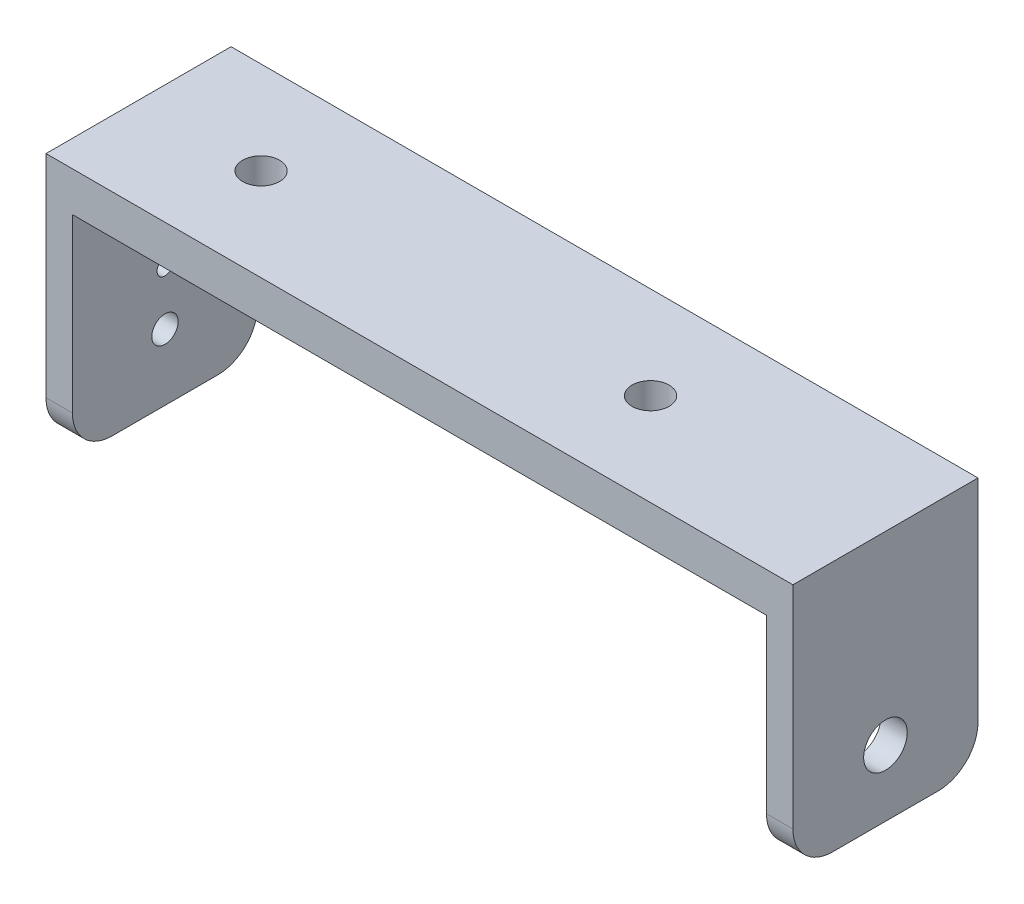
ISO-10303-21;
HEADER;
FILE_DESCRIPTION(('STEP AP214'),'2;1');
FILE_NAME('part.step','',(''),(''),'','','');
FILE_SCHEMA(('AUTOMOTIVE_DESIGN { 1 0 10303 214 1 1 1 1 }'));
ENDSEC;
DATA;
#1=APPLICATION_CONTEXT('core data for automotive mechanical design processes');
#2=APPLICATION_PROTOCOL_DEFINITION('international standard','automotive_design',2000,#1);
#3=PRODUCT_CONTEXT('',#1,'mechanical');
#4=PRODUCT('Part','Part','',(#3));
#5=PRODUCT_RELATED_PRODUCT_CATEGORY('part','',(#4));
#6=PRODUCT_DEFINITION_FORMATION('','',#4);
#7=PRODUCT_DEFINITION_CONTEXT('part definition',#1,'design');
#8=PRODUCT_DEFINITION('design','',#6,#7);
#9=PRODUCT_DEFINITION_SHAPE('','',#8);
#10=(LENGTH_UNIT() NAMED_UNIT(*) SI_UNIT(.MILLI.,.METRE.));
#11=(NAMED_UNIT(*) PLANE_ANGLE_UNIT() SI_UNIT($,.RADIAN.));
#12=(NAMED_UNIT(*) SI_UNIT($,.STERADIAN.) SOLID_ANGLE_UNIT());
#13=UNCERTAINTY_MEASURE_WITH_UNIT(LENGTH_MEASURE(1.E-05),#10,'distance_accuracy_value','');
#14=(GEOMETRIC_REPRESENTATION_CONTEXT(3) GLOBAL_UNCERTAINTY_ASSIGNED_CONTEXT((#13)) GLOBAL_UNIT_ASSIGNED_CONTEXT((#10,
#11,#12)) REPRESENTATION_CONTEXT('',''));
#15=CARTESIAN_POINT('',(0.,0.,0.));
#16=DIRECTION('',(0.,0.,1.));
#17=DIRECTION('',(1.,0.,0.));
#18=AXIS2_PLACEMENT_3D('',#15,#16,#17);
#19=CARTESIAN_POINT('',(0.,16.,14.));
#20=DIRECTION('',(0.,-1.,0.));
#21=DIRECTION('',(1.,0.,0.));
#22=AXIS2_PLACEMENT_3D('',#19,#20,#21);
#23=PLANE('',#22);
#24=CARTESIAN_POINT('',(-18.98,16.,7.));
#25=DIRECTION('',(0.,-1.,0.));
#26=DIRECTION('',(1.,0.,0.));
#27=AXIS2_PLACEMENT_3D('',#24,#25,#26);
#28=CIRCLE('',#27,1.4);
#29=CARTESIAN_POINT('',(-17.58,16.,7.));
#30=VERTEX_POINT('',#29);
#31=EDGE_CURVE('E253',#30,#30,#28,.T.);
#32=ORIENTED_EDGE('',*,*,#31,.F.);
#33=EDGE_LOOP('',(#32));
#34=FACE_BOUND('',#33,.T.);
#35=CARTESIAN_POINT('',(10.48,16.,7.));
#36=DIRECTION('',(0.,-1.,0.));
#37=DIRECTION('',(1.,0.,0.));
#38=AXIS2_PLACEMENT_3D('',#35,#36,#37);
#39=CIRCLE('',#38,1.4);
#40=CARTESIAN_POINT('',(11.88,16.,7.));
#41=VERTEX_POINT('',#40);
#42=EDGE_CURVE('E247',#41,#41,#39,.T.);
#43=ORIENTED_EDGE('',*,*,#42,.F.);
#44=EDGE_LOOP('',(#43));
#45=FACE_BOUND('',#44,.T.);
#46=DIRECTION('',(-1.,0.,0.));
#47=VECTOR('',#46,1.);
#48=CARTESIAN_POINT('',(0.,16.,0.));
#49=LINE('',#48,#47);
#50=CARTESIAN_POINT('',(26.25,16.,0.));
#51=VERTEX_POINT('',#50);
#52=CARTESIAN_POINT('',(-26.25,16.,0.));
#53=VERTEX_POINT('',#52);
#54=EDGE_CURVE('E152',#51,#53,#49,.T.);
#55=ORIENTED_EDGE('',*,*,#54,.F.);
#56=DIRECTION('',(0.,0.,-1.));
#57=VECTOR('',#56,1.);
#58=CARTESIAN_POINT('',(26.25,16.,14.));
#59=LINE('',#58,#57);
#60=CARTESIAN_POINT('',(26.25,16.,14.));
#61=VERTEX_POINT('',#60);
#62=EDGE_CURVE('E139',#61,#51,#59,.T.);
#63=ORIENTED_EDGE('',*,*,#62,.F.);
#64=DIRECTION('',(-1.,0.,0.));
#65=VECTOR('',#64,1.);
#66=CARTESIAN_POINT('',(0.,16.,14.));
#67=LINE('',#66,#65);
#68=CARTESIAN_POINT('',(-26.25,16.,14.));
#69=VERTEX_POINT('',#68);
#70=EDGE_CURVE('E146',#61,#69,#67,.T.);
#71=ORIENTED_EDGE('',*,*,#70,.T.);
#72=DIRECTION('',(0.,0.,-1.));
#73=VECTOR('',#72,1.);
#74=CARTESIAN_POINT('',(-26.25,16.,14.));
#75=LINE('',#74,#73);
#76=EDGE_CURVE('E175',#69,#53,#75,.T.);
#77=ORIENTED_EDGE('',*,*,#76,.T.);
#78=EDGE_LOOP('',(#55,#63,#71,#77));
#79=FACE_BOUND('',#78,.T.);
#80=ADVANCED_FACE('F41',(#34,#45,#79),#23,.T.);
#81=CARTESIAN_POINT('',(26.25,0.,14.));
#82=DIRECTION('',(-1.,0.,0.));
#83=DIRECTION('',(0.,0.,1.));
#84=AXIS2_PLACEMENT_3D('',#81,#82,#83);
#85=PLANE('',#84);
#86=CARTESIAN_POINT('',(26.25,5.00000000000001,7.));
#87=DIRECTION('',(-1.,0.,0.));
#88=DIRECTION('',(0.,0.,1.));
#89=AXIS2_PLACEMENT_3D('',#86,#87,#88);
#90=CIRCLE('',#89,1.65);
#91=CARTESIAN_POINT('',(26.25,5.00000000000001,8.65));
#92=VERTEX_POINT('',#91);
#93=EDGE_CURVE('E164',#92,#92,#90,.F.);
#94=ORIENTED_EDGE('',*,*,#93,.T.);
#95=EDGE_LOOP('',(#94));
#96=FACE_BOUND('',#95,.T.);
#97=DIRECTION('',(0.,0.,-1.));
#98=VECTOR('',#97,1.);
#99=CARTESIAN_POINT('',(26.25,0.,14.));
#100=LINE('',#99,#98);
#101=CARTESIAN_POINT('',(26.25,0.,11.));
#102=VERTEX_POINT('',#101);
#103=CARTESIAN_POINT('',(26.25,0.,3.));
#104=VERTEX_POINT('',#103);
#105=EDGE_CURVE('E154',#102,#104,#100,.T.);
#106=ORIENTED_EDGE('',*,*,#105,.F.);
#107=CARTESIAN_POINT('',(26.25,3.,11.));
#108=DIRECTION('',(-1.,0.,0.));
#109=DIRECTION('',(0.,0.,1.));
#110=AXIS2_PLACEMENT_3D('',#107,#108,#109);
#111=CIRCLE('',#110,3.);
#112=CARTESIAN_POINT('',(26.25,3.,14.));
#113=VERTEX_POINT('',#112);
#114=EDGE_CURVE('E141',#102,#113,#111,.T.);
#115=ORIENTED_EDGE('',*,*,#114,.T.);
#116=DIRECTION('',(0.,1.,0.));
#117=VECTOR('',#116,1.);
#118=CARTESIAN_POINT('',(26.25,0.,14.));
#119=LINE('',#118,#117);
#120=EDGE_CURVE('E134',#113,#61,#119,.T.);
#121=ORIENTED_EDGE('',*,*,#120,.T.);
#122=ORIENTED_EDGE('',*,*,#62,.T.);
#123=DIRECTION('',(0.,1.,0.));
#124=VECTOR('',#123,1.);
#125=CARTESIAN_POINT('',(26.25,0.,0.));
#126=LINE('',#125,#124);
#127=CARTESIAN_POINT('',(26.25,3.,0.));
#128=VERTEX_POINT('',#127);
#129=EDGE_CURVE('E177',#128,#51,#126,.T.);
#130=ORIENTED_EDGE('',*,*,#129,.F.);
#131=CARTESIAN_POINT('',(26.25,3.,3.));
#132=DIRECTION('',(-1.,0.,0.));
#133=DIRECTION('',(0.,0.,1.));
#134=AXIS2_PLACEMENT_3D('',#131,#132,#133);
#135=CIRCLE('',#134,3.);
#136=EDGE_CURVE('E206',#128,#104,#135,.T.);
#137=ORIENTED_EDGE('',*,*,#136,.T.);
#138=EDGE_LOOP('',(#106,#115,#121,#122,#130,#137));
#139=FACE_BOUND('',#138,.T.);
#140=ADVANCED_FACE('F137',(#96,#139),#85,.T.);
#141=CARTESIAN_POINT('',(0.,0.,14.));
#142=DIRECTION('',(0.,-1.,0.));
#143=DIRECTION('',(1.,0.,0.));
#144=AXIS2_PLACEMENT_3D('',#141,#142,#143);
#145=PLANE('',#144);
#146=DIRECTION('',(0.,0.,-1.));
#147=VECTOR('',#146,1.);
#148=CARTESIAN_POINT('',(28.25,0.,14.));
#149=LINE('',#148,#147);
#150=CARTESIAN_POINT('',(28.25,0.,11.));
#151=VERTEX_POINT('',#150);
#152=CARTESIAN_POINT('',(28.25,0.,3.));
#153=VERTEX_POINT('',#152);
#154=EDGE_CURVE('E197',#151,#153,#149,.T.);
#155=ORIENTED_EDGE('',*,*,#154,.F.);
#156=DIRECTION('',(-1.,0.,0.));
#157=VECTOR('',#156,1.);
#158=CARTESIAN_POINT('',(0.,0.,11.));
#159=LINE('',#158,#157);
#160=EDGE_CURVE('E203',#151,#102,#159,.T.);
#161=ORIENTED_EDGE('',*,*,#160,.T.);
#162=ORIENTED_EDGE('',*,*,#105,.T.);
#163=DIRECTION('',(-1.,0.,0.));
#164=VECTOR('',#163,1.);
#165=CARTESIAN_POINT('',(28.25,0.,3.));
#166=LINE('',#165,#164);
#167=EDGE_CURVE('E153',#104,#153,#166,.F.);
#168=ORIENTED_EDGE('',*,*,#167,.T.);
#169=EDGE_LOOP('',(#155,#161,#162,#168));
#170=FACE_BOUND('',#169,.T.);
#171=ADVANCED_FACE('F284',(#170),#145,.T.);
#172=CARTESIAN_POINT('',(28.25,0.,14.));
#173=DIRECTION('',(1.,0.,0.));
#174=DIRECTION('',(0.,1.,0.));
#175=AXIS2_PLACEMENT_3D('',#172,#173,#174);
#176=PLANE('',#175);
#177=CARTESIAN_POINT('',(28.25,5.00000000000001,7.));
#178=DIRECTION('',(1.,0.,0.));
#179=DIRECTION('',(0.,0.,-1.));
#180=AXIS2_PLACEMENT_3D('',#177,#178,#179);
#181=CIRCLE('',#180,1.65);
#182=CARTESIAN_POINT('',(28.25,5.00000000000001,5.35));
#183=VERTEX_POINT('',#182);
#184=EDGE_CURVE('E255',#183,#183,#181,.T.);
#185=ORIENTED_EDGE('',*,*,#184,.F.);
#186=EDGE_LOOP('',(#185));
#187=FACE_BOUND('',#186,.T.);
#188=DIRECTION('',(0.,-1.,0.));
#189=VECTOR('',#188,1.);
#190=CARTESIAN_POINT('',(28.25,0.,14.));
#191=LINE('',#190,#189);
#192=CARTESIAN_POINT('',(28.25,19.,14.));
#193=VERTEX_POINT('',#192);
#194=CARTESIAN_POINT('',(28.25,3.,14.));
#195=VERTEX_POINT('',#194);
#196=EDGE_CURVE('E145',#193,#195,#191,.T.);
#197=ORIENTED_EDGE('',*,*,#196,.T.);
#198=CARTESIAN_POINT('',(28.25,3.,11.));
#199=DIRECTION('',(1.,0.,0.));
#200=DIRECTION('',(0.,1.,0.));
#201=AXIS2_PLACEMENT_3D('',#198,#199,#200);
#202=CIRCLE('',#201,3.);
#203=EDGE_CURVE('E215',#195,#151,#202,.T.);
#204=ORIENTED_EDGE('',*,*,#203,.T.);
#205=ORIENTED_EDGE('',*,*,#154,.T.);
#206=CARTESIAN_POINT('',(28.25,3.,3.));
#207=DIRECTION('',(1.,0.,0.));
#208=DIRECTION('',(0.,1.,0.));
#209=AXIS2_PLACEMENT_3D('',#206,#207,#208);
#210=CIRCLE('',#209,3.);
#211=CARTESIAN_POINT('',(28.25,3.,0.));
#212=VERTEX_POINT('',#211);
#213=EDGE_CURVE('E213',#153,#212,#210,.T.);
#214=ORIENTED_EDGE('',*,*,#213,.T.);
#215=DIRECTION('',(0.,-1.,0.));
#216=VECTOR('',#215,1.);
#217=CARTESIAN_POINT('',(28.25,0.,0.));
#218=LINE('',#217,#216);
#219=CARTESIAN_POINT('',(28.25,19.,0.));
#220=VERTEX_POINT('',#219);
#221=EDGE_CURVE('E179',#220,#212,#218,.T.);
#222=ORIENTED_EDGE('',*,*,#221,.F.);
#223=DIRECTION('',(0.,0.,-1.));
#224=VECTOR('',#223,1.);
#225=CARTESIAN_POINT('',(28.25,19.,14.));
#226=LINE('',#225,#224);
#227=EDGE_CURVE('E195',#193,#220,#226,.T.);
#228=ORIENTED_EDGE('',*,*,#227,.F.);
#229=EDGE_LOOP('',(#197,#204,#205,#214,#222,#228));
#230=FACE_BOUND('',#229,.T.);
#231=ADVANCED_FACE('F324',(#187,#230),#176,.T.);
#232=CARTESIAN_POINT('',(0.,19.,14.));
#233=DIRECTION('',(0.,1.,0.));
#234=DIRECTION('',(0.,0.,1.));
#235=AXIS2_PLACEMENT_3D('',#232,#233,#234);
#236=PLANE('',#235);
#237=CARTESIAN_POINT('',(-18.98,19.,7.));
#238=DIRECTION('',(0.,1.,0.));
#239=DIRECTION('',(0.,0.,1.));
#240=AXIS2_PLACEMENT_3D('',#237,#238,#239);
#241=CIRCLE('',#240,1.4);
#242=CARTESIAN_POINT('',(-18.98,19.,8.4));
#243=VERTEX_POINT('',#242);
#244=EDGE_CURVE('E242',#243,#243,#241,.T.);
#245=ORIENTED_EDGE('',*,*,#244,.F.);
#246=EDGE_LOOP('',(#245));
#247=FACE_BOUND('',#246,.T.);
#248=CARTESIAN_POINT('',(10.48,19.,7.));
#249=DIRECTION('',(0.,1.,0.));
#250=DIRECTION('',(0.,0.,1.));
#251=AXIS2_PLACEMENT_3D('',#248,#249,#250);
#252=CIRCLE('',#251,1.4);
#253=CARTESIAN_POINT('',(10.48,19.,8.4));
#254=VERTEX_POINT('',#253);
#255=EDGE_CURVE('E238',#254,#254,#252,.T.);
#256=ORIENTED_EDGE('',*,*,#255,.F.);
#257=EDGE_LOOP('',(#256));
#258=FACE_BOUND('',#257,.T.);
#259=DIRECTION('',(1.,0.,0.));
#260=VECTOR('',#259,1.);
#261=CARTESIAN_POINT('',(0.,19.,0.));
#262=LINE('',#261,#260);
#263=CARTESIAN_POINT('',(-28.25,19.,0.));
#264=VERTEX_POINT('',#263);
#265=EDGE_CURVE('E182',#264,#220,#262,.T.);
#266=ORIENTED_EDGE('',*,*,#265,.F.);
#267=DIRECTION('',(0.,0.,-1.));
#268=VECTOR('',#267,1.);
#269=CARTESIAN_POINT('',(-28.25,19.,14.));
#270=LINE('',#269,#268);
#271=CARTESIAN_POINT('',(-28.25,19.,14.));
#272=VERTEX_POINT('',#271);
#273=EDGE_CURVE('E192',#272,#264,#270,.T.);
#274=ORIENTED_EDGE('',*,*,#273,.F.);
#275=DIRECTION('',(1.,0.,0.));
#276=VECTOR('',#275,1.);
#277=CARTESIAN_POINT('',(0.,19.,14.));
#278=LINE('',#277,#276);
#279=EDGE_CURVE('E169',#272,#193,#278,.T.);
#280=ORIENTED_EDGE('',*,*,#279,.T.);
#281=ORIENTED_EDGE('',*,*,#227,.T.);
#282=EDGE_LOOP('',(#266,#274,#280,#281));
#283=FACE_BOUND('',#282,.T.);
#284=ADVANCED_FACE('F313',(#247,#258,#283),#236,.T.);
#285=CARTESIAN_POINT('',(-28.25,0.,14.));
#286=DIRECTION('',(-1.,0.,0.));
#287=DIRECTION('',(0.,0.,1.));
#288=AXIS2_PLACEMENT_3D('',#285,#286,#287);
#289=PLANE('',#288);
#290=CARTESIAN_POINT('',(-28.25,5.00000000000001,7.));
#291=DIRECTION('',(-1.,0.,0.));
#292=DIRECTION('',(0.,0.,1.));
#293=AXIS2_PLACEMENT_3D('',#290,#291,#292);
#294=CIRCLE('',#293,1.);
#295=CARTESIAN_POINT('',(-28.25,5.00000000000001,8.));
#296=VERTEX_POINT('',#295);
#297=EDGE_CURVE('E476',#296,#296,#294,.T.);
#298=ORIENTED_EDGE('',*,*,#297,.F.);
#299=EDGE_LOOP('',(#298));
#300=FACE_BOUND('',#299,.T.);
#301=CARTESIAN_POINT('',(-28.25,13.085,7.));
#302=DIRECTION('',(-1.,0.,0.));
#303=DIRECTION('',(0.,0.,1.));
#304=AXIS2_PLACEMENT_3D('',#301,#302,#303);
#305=CIRCLE('',#304,0.6);
#306=CARTESIAN_POINT('',(-28.25,13.085,7.6));
#307=VERTEX_POINT('',#306);
#308=EDGE_CURVE('E477',#307,#307,#305,.T.);
#309=ORIENTED_EDGE('',*,*,#308,.F.);
#310=EDGE_LOOP('',(#309));
#311=FACE_BOUND('',#310,.T.);
#312=CARTESIAN_POINT('',(-28.25,9.08500000000001,7.));
#313=DIRECTION('',(-1.,0.,0.));
#314=DIRECTION('',(0.,0.,1.));
#315=AXIS2_PLACEMENT_3D('',#312,#313,#314);
#316=CIRCLE('',#315,0.6);
#317=CARTESIAN_POINT('',(-28.25,9.08500000000001,7.6));
#318=VERTEX_POINT('',#317);
#319=EDGE_CURVE('E233',#318,#318,#316,.T.);
#320=ORIENTED_EDGE('',*,*,#319,.F.);
#321=EDGE_LOOP('',(#320));
#322=FACE_BOUND('',#321,.T.);
#323=DIRECTION('',(0.,0.,-1.));
#324=VECTOR('',#323,1.);
#325=CARTESIAN_POINT('',(-28.25,0.,14.));
#326=LINE('',#325,#324);
#327=CARTESIAN_POINT('',(-28.25,0.,11.));
#328=VERTEX_POINT('',#327);
#329=CARTESIAN_POINT('',(-28.25,0.,3.));
#330=VERTEX_POINT('',#329);
#331=EDGE_CURVE('E189',#328,#330,#326,.T.);
#332=ORIENTED_EDGE('',*,*,#331,.F.);
#333=CARTESIAN_POINT('',(-28.25,2.99999999999996,11.));
#334=DIRECTION('',(-1.,0.,0.));
#335=DIRECTION('',(0.,0.,1.));
#336=AXIS2_PLACEMENT_3D('',#333,#334,#335);
#337=CIRCLE('',#336,3.);
#338=CARTESIAN_POINT('',(-28.25,2.99999999999996,14.));
#339=VERTEX_POINT('',#338);
#340=EDGE_CURVE('E223',#328,#339,#337,.T.);
#341=ORIENTED_EDGE('',*,*,#340,.T.);
#342=DIRECTION('',(0.,1.,0.));
#343=VECTOR('',#342,1.);
#344=CARTESIAN_POINT('',(-28.25,0.,14.));
#345=LINE('',#344,#343);
#346=EDGE_CURVE('E172',#339,#272,#345,.T.);
#347=ORIENTED_EDGE('',*,*,#346,.T.);
#348=ORIENTED_EDGE('',*,*,#273,.T.);
#349=DIRECTION('',(0.,1.,0.));
#350=VECTOR('',#349,1.);
#351=CARTESIAN_POINT('',(-28.25,0.,0.));
#352=LINE('',#351,#350);
#353=CARTESIAN_POINT('',(-28.25,2.99999999999996,0.));
#354=VERTEX_POINT('',#353);
#355=EDGE_CURVE('E161',#354,#264,#352,.T.);
#356=ORIENTED_EDGE('',*,*,#355,.F.);
#357=CARTESIAN_POINT('',(-28.25,2.99999999999996,3.));
#358=DIRECTION('',(-1.,0.,0.));
#359=DIRECTION('',(0.,0.,1.));
#360=AXIS2_PLACEMENT_3D('',#357,#358,#359);
#361=CIRCLE('',#360,3.);
#362=EDGE_CURVE('E66',#354,#330,#361,.T.);
#363=ORIENTED_EDGE('',*,*,#362,.T.);
#364=EDGE_LOOP('',(#332,#341,#347,#348,#356,#363));
#365=FACE_BOUND('',#364,.T.);
#366=ADVANCED_FACE('F307',(#300,#311,#322,#365),#289,.T.);
#367=CARTESIAN_POINT('',(0.,0.,14.));
#368=DIRECTION('',(0.,-1.,0.));
#369=DIRECTION('',(1.,0.,0.));
#370=AXIS2_PLACEMENT_3D('',#367,#368,#369);
#371=PLANE('',#370);
#372=DIRECTION('',(0.,0.,-1.));
#373=VECTOR('',#372,1.);
#374=CARTESIAN_POINT('',(-26.25,0.,14.));
#375=LINE('',#374,#373);
#376=CARTESIAN_POINT('',(-26.25,0.,11.));
#377=VERTEX_POINT('',#376);
#378=CARTESIAN_POINT('',(-26.25,0.,3.));
#379=VERTEX_POINT('',#378);
#380=EDGE_CURVE('E187',#377,#379,#375,.T.);
#381=ORIENTED_EDGE('',*,*,#380,.F.);
#382=DIRECTION('',(-1.,0.,0.));
#383=VECTOR('',#382,1.);
#384=CARTESIAN_POINT('',(0.,0.,11.));
#385=LINE('',#384,#383);
#386=EDGE_CURVE('E219',#377,#328,#385,.T.);
#387=ORIENTED_EDGE('',*,*,#386,.T.);
#388=ORIENTED_EDGE('',*,*,#331,.T.);
#389=DIRECTION('',(-1.,0.,0.));
#390=VECTOR('',#389,1.);
#391=CARTESIAN_POINT('',(-26.25,0.,3.));
#392=LINE('',#391,#390);
#393=EDGE_CURVE('E217',#330,#379,#392,.F.);
#394=ORIENTED_EDGE('',*,*,#393,.T.);
#395=EDGE_LOOP('',(#381,#387,#388,#394));
#396=FACE_BOUND('',#395,.T.);
#397=ADVANCED_FACE('F337',(#396),#371,.T.);
#398=CARTESIAN_POINT('',(-26.25,0.,14.));
#399=DIRECTION('',(1.,0.,0.));
#400=DIRECTION('',(0.,1.,0.));
#401=AXIS2_PLACEMENT_3D('',#398,#399,#400);
#402=PLANE('',#401);
#403=CARTESIAN_POINT('',(-26.25,5.00000000000001,7.));
#404=DIRECTION('',(1.,0.,0.));
#405=DIRECTION('',(0.,1.,0.));
#406=AXIS2_PLACEMENT_3D('',#403,#404,#405);
#407=CIRCLE('',#406,1.);
#408=CARTESIAN_POINT('',(-26.25,6.00000000000001,7.));
#409=VERTEX_POINT('',#408);
#410=EDGE_CURVE('E45',#409,#409,#407,.T.);
#411=ORIENTED_EDGE('',*,*,#410,.F.);
#412=EDGE_LOOP('',(#411));
#413=FACE_BOUND('',#412,.T.);
#414=CARTESIAN_POINT('',(-26.25,13.085,7.));
#415=DIRECTION('',(1.,0.,0.));
#416=DIRECTION('',(0.,1.,0.));
#417=AXIS2_PLACEMENT_3D('',#414,#415,#416);
#418=CIRCLE('',#417,0.6);
#419=CARTESIAN_POINT('',(-26.25,13.685,7.));
#420=VERTEX_POINT('',#419);
#421=EDGE_CURVE('E232',#420,#420,#418,.T.);
#422=ORIENTED_EDGE('',*,*,#421,.F.);
#423=EDGE_LOOP('',(#422));
#424=FACE_BOUND('',#423,.T.);
#425=CARTESIAN_POINT('',(-26.25,9.08500000000001,7.));
#426=DIRECTION('',(1.,0.,0.));
#427=DIRECTION('',(0.,1.,0.));
#428=AXIS2_PLACEMENT_3D('',#425,#426,#427);
#429=CIRCLE('',#428,0.6);
#430=CARTESIAN_POINT('',(-26.25,9.68500000000001,7.));
#431=VERTEX_POINT('',#430);
#432=EDGE_CURVE('E230',#431,#431,#429,.T.);
#433=ORIENTED_EDGE('',*,*,#432,.F.);
#434=EDGE_LOOP('',(#433));
#435=FACE_BOUND('',#434,.T.);
#436=DIRECTION('',(0.,-1.,0.));
#437=VECTOR('',#436,1.);
#438=CARTESIAN_POINT('',(-26.25,0.,14.));
#439=LINE('',#438,#437);
#440=CARTESIAN_POINT('',(-26.25,2.99999999999996,14.));
#441=VERTEX_POINT('',#440);
#442=EDGE_CURVE('E158',#69,#441,#439,.T.);
#443=ORIENTED_EDGE('',*,*,#442,.T.);
#444=CARTESIAN_POINT('',(-26.25,2.99999999999996,11.));
#445=DIRECTION('',(1.,0.,0.));
#446=DIRECTION('',(0.,1.,0.));
#447=AXIS2_PLACEMENT_3D('',#444,#445,#446);
#448=CIRCLE('',#447,3.);
#449=EDGE_CURVE('E226',#441,#377,#448,.T.);
#450=ORIENTED_EDGE('',*,*,#449,.T.);
#451=ORIENTED_EDGE('',*,*,#380,.T.);
#452=CARTESIAN_POINT('',(-26.25,2.99999999999996,3.));
#453=DIRECTION('',(1.,0.,0.));
#454=DIRECTION('',(0.,1.,0.));
#455=AXIS2_PLACEMENT_3D('',#452,#453,#454);
#456=CIRCLE('',#455,3.);
#457=CARTESIAN_POINT('',(-26.25,2.99999999999996,0.));
#458=VERTEX_POINT('',#457);
#459=EDGE_CURVE('E58',#379,#458,#456,.T.);
#460=ORIENTED_EDGE('',*,*,#459,.T.);
#461=DIRECTION('',(0.,-1.,0.));
#462=VECTOR('',#461,1.);
#463=CARTESIAN_POINT('',(-26.25,0.,0.));
#464=LINE('',#463,#462);
#465=EDGE_CURVE('E159',#53,#458,#464,.T.);
#466=ORIENTED_EDGE('',*,*,#465,.F.);
#467=ORIENTED_EDGE('',*,*,#76,.F.);
#468=EDGE_LOOP('',(#443,#450,#451,#460,#466,#467));
#469=FACE_BOUND('',#468,.T.);
#470=ADVANCED_FACE('F341',(#413,#424,#435,#469),#402,.T.);
#471=CARTESIAN_POINT('',(0.,0.,14.));
#472=DIRECTION('',(0.,0.,1.));
#473=DIRECTION('',(1.,0.,0.));
#474=AXIS2_PLACEMENT_3D('',#471,#472,#473);
#475=PLANE('',#474);
#476=ORIENTED_EDGE('',*,*,#120,.F.);
#477=DIRECTION('',(-1.,0.,0.));
#478=VECTOR('',#477,1.);
#479=CARTESIAN_POINT('',(0.,3.,14.));
#480=LINE('',#479,#478);
#481=EDGE_CURVE('E211',#113,#195,#480,.F.);
#482=ORIENTED_EDGE('',*,*,#481,.T.);
#483=ORIENTED_EDGE('',*,*,#196,.F.);
#484=ORIENTED_EDGE('',*,*,#279,.F.);
#485=ORIENTED_EDGE('',*,*,#346,.F.);
#486=DIRECTION('',(-1.,0.,0.));
#487=VECTOR('',#486,1.);
#488=CARTESIAN_POINT('',(0.,3.,14.));
#489=LINE('',#488,#487);
#490=EDGE_CURVE('E209',#339,#441,#489,.F.);
#491=ORIENTED_EDGE('',*,*,#490,.T.);
#492=ORIENTED_EDGE('',*,*,#442,.F.);
#493=ORIENTED_EDGE('',*,*,#70,.F.);
#494=EDGE_LOOP('',(#476,#482,#483,#484,#485,#491,#492,#493));
#495=FACE_BOUND('',#494,.T.);
#496=ADVANCED_FACE('F156',(#495),#475,.T.);
#497=CARTESIAN_POINT('',(0.,0.,0.));
#498=DIRECTION('',(0.,0.,1.));
#499=DIRECTION('',(1.,0.,0.));
#500=AXIS2_PLACEMENT_3D('',#497,#498,#499);
#501=PLANE('',#500);
#502=ORIENTED_EDGE('',*,*,#465,.T.);
#503=DIRECTION('',(-1.,0.,0.));
#504=VECTOR('',#503,1.);
#505=CARTESIAN_POINT('',(-28.25,2.99999999999996,0.));
#506=LINE('',#505,#504);
#507=EDGE_CURVE('E11',#458,#354,#506,.T.);
#508=ORIENTED_EDGE('',*,*,#507,.T.);
#509=ORIENTED_EDGE('',*,*,#355,.T.);
#510=ORIENTED_EDGE('',*,*,#265,.T.);
#511=ORIENTED_EDGE('',*,*,#221,.T.);
#512=DIRECTION('',(-1.,0.,0.));
#513=VECTOR('',#512,1.);
#514=CARTESIAN_POINT('',(26.25,3.,0.));
#515=LINE('',#514,#513);
#516=EDGE_CURVE('E50',#212,#128,#515,.T.);
#517=ORIENTED_EDGE('',*,*,#516,.T.);
#518=ORIENTED_EDGE('',*,*,#129,.T.);
#519=ORIENTED_EDGE('',*,*,#54,.T.);
#520=EDGE_LOOP('',(#502,#508,#509,#510,#511,#517,#518,#519));
#521=FACE_BOUND('',#520,.T.);
#522=ADVANCED_FACE('F266',(#521),#501,.F.);
#523=CARTESIAN_POINT('',(21.5830952441688,5.00000000000001,7.));
#524=DIRECTION('',(1.,0.,0.));
#525=DIRECTION('',(0.,0.,-1.));
#526=AXIS2_PLACEMENT_3D('',#523,#524,#525);
#527=CYLINDRICAL_SURFACE('',#526,1.65);
#528=ORIENTED_EDGE('',*,*,#184,.T.);
#529=EDGE_LOOP('',(#528));
#530=FACE_BOUND('',#529,.T.);
#531=ORIENTED_EDGE('',*,*,#93,.F.);
#532=EDGE_LOOP('',(#531));
#533=FACE_BOUND('',#532,.T.);
#534=ADVANCED_FACE('F263',(#530,#533),#527,.F.);
#535=CARTESIAN_POINT('',(10.48,5.,7.));
#536=DIRECTION('',(0.,1.,0.));
#537=DIRECTION('',(0.,0.,1.));
#538=AXIS2_PLACEMENT_3D('',#535,#536,#537);
#539=CYLINDRICAL_SURFACE('',#538,1.4);
#540=ORIENTED_EDGE('',*,*,#42,.T.);
#541=EDGE_LOOP('',(#540));
#542=FACE_BOUND('',#541,.T.);
#543=ORIENTED_EDGE('',*,*,#255,.T.);
#544=EDGE_LOOP('',(#543));
#545=FACE_BOUND('',#544,.T.);
#546=ADVANCED_FACE('F265',(#542,#545),#539,.F.);
#547=CARTESIAN_POINT('',(-18.98,5.,7.));
#548=DIRECTION('',(0.,1.,0.));
#549=DIRECTION('',(0.,0.,1.));
#550=AXIS2_PLACEMENT_3D('',#547,#548,#549);
#551=CYLINDRICAL_SURFACE('',#550,1.4);
#552=ORIENTED_EDGE('',*,*,#31,.T.);
#553=EDGE_LOOP('',(#552));
#554=FACE_BOUND('',#553,.T.);
#555=ORIENTED_EDGE('',*,*,#244,.T.);
#556=EDGE_LOOP('',(#555));
#557=FACE_BOUND('',#556,.T.);
#558=ADVANCED_FACE('F272',(#554,#557),#551,.F.);
#559=CARTESIAN_POINT('',(0.,3.,11.));
#560=DIRECTION('',(-1.,0.,0.));
#561=DIRECTION('',(0.,-1.,0.));
#562=AXIS2_PLACEMENT_3D('',#559,#560,#561);
#563=CYLINDRICAL_SURFACE('',#562,3.);
#564=ORIENTED_EDGE('',*,*,#203,.F.);
#565=ORIENTED_EDGE('',*,*,#481,.F.);
#566=ORIENTED_EDGE('',*,*,#114,.F.);
#567=ORIENTED_EDGE('',*,*,#160,.F.);
#568=EDGE_LOOP('',(#564,#565,#566,#567));
#569=FACE_BOUND('',#568,.T.);
#570=ADVANCED_FACE('F290',(#569),#563,.T.);
#571=CARTESIAN_POINT('',(0.,3.,11.));
#572=DIRECTION('',(-1.,0.,0.));
#573=DIRECTION('',(0.,-1.,0.));
#574=AXIS2_PLACEMENT_3D('',#571,#572,#573);
#575=CYLINDRICAL_SURFACE('',#574,3.);
#576=ORIENTED_EDGE('',*,*,#449,.F.);
#577=ORIENTED_EDGE('',*,*,#490,.F.);
#578=ORIENTED_EDGE('',*,*,#340,.F.);
#579=ORIENTED_EDGE('',*,*,#386,.F.);
#580=EDGE_LOOP('',(#576,#577,#578,#579));
#581=FACE_BOUND('',#580,.T.);
#582=ADVANCED_FACE('F293',(#581),#575,.T.);
#583=CARTESIAN_POINT('',(0.,3.,3.));
#584=DIRECTION('',(1.,0.,0.));
#585=DIRECTION('',(0.,1.,0.));
#586=AXIS2_PLACEMENT_3D('',#583,#584,#585);
#587=CYLINDRICAL_SURFACE('',#586,3.);
#588=ORIENTED_EDGE('',*,*,#459,.F.);
#589=ORIENTED_EDGE('',*,*,#393,.F.);
#590=ORIENTED_EDGE('',*,*,#362,.F.);
#591=ORIENTED_EDGE('',*,*,#507,.F.);
#592=EDGE_LOOP('',(#588,#589,#590,#591));
#593=FACE_BOUND('',#592,.T.);
#594=ADVANCED_FACE('F296',(#593),#587,.T.);
#595=CARTESIAN_POINT('',(0.,3.,3.));
#596=DIRECTION('',(1.,0.,0.));
#597=DIRECTION('',(0.,1.,0.));
#598=AXIS2_PLACEMENT_3D('',#595,#596,#597);
#599=CYLINDRICAL_SURFACE('',#598,3.);
#600=ORIENTED_EDGE('',*,*,#213,.F.);
#601=ORIENTED_EDGE('',*,*,#167,.F.);
#602=ORIENTED_EDGE('',*,*,#136,.F.);
#603=ORIENTED_EDGE('',*,*,#516,.F.);
#604=EDGE_LOOP('',(#600,#601,#602,#603));
#605=FACE_BOUND('',#604,.T.);
#606=ADVANCED_FACE('F43',(#605),#599,.T.);
#607=CARTESIAN_POINT('',(-18.25,9.08500000000001,7.));
#608=DIRECTION('',(-1.,0.,0.));
#609=DIRECTION('',(0.,0.,1.));
#610=AXIS2_PLACEMENT_3D('',#607,#608,#609);
#611=CYLINDRICAL_SURFACE('',#610,0.6);
#612=ORIENTED_EDGE('',*,*,#432,.T.);
#613=EDGE_LOOP('',(#612));
#614=FACE_BOUND('',#613,.T.);
#615=ORIENTED_EDGE('',*,*,#319,.T.);
#616=EDGE_LOOP('',(#615));
#617=FACE_BOUND('',#616,.T.);
#618=ADVANCED_FACE('F302',(#614,#617),#611,.F.);
#619=CARTESIAN_POINT('',(-18.25,13.085,7.));
#620=DIRECTION('',(-1.,0.,0.));
#621=DIRECTION('',(0.,0.,1.));
#622=AXIS2_PLACEMENT_3D('',#619,#620,#621);
#623=CYLINDRICAL_SURFACE('',#622,0.6);
#624=ORIENTED_EDGE('',*,*,#421,.T.);
#625=EDGE_LOOP('',(#624));
#626=FACE_BOUND('',#625,.T.);
#627=ORIENTED_EDGE('',*,*,#308,.T.);
#628=EDGE_LOOP('',(#627));
#629=FACE_BOUND('',#628,.T.);
#630=ADVANCED_FACE('F403',(#626,#629),#623,.F.);
#631=CARTESIAN_POINT('',(-18.25,5.00000000000001,7.));
#632=DIRECTION('',(-1.,0.,0.));
#633=DIRECTION('',(0.,0.,1.));
#634=AXIS2_PLACEMENT_3D('',#631,#632,#633);
#635=CYLINDRICAL_SURFACE('',#634,1.);
#636=ORIENTED_EDGE('',*,*,#410,.T.);
#637=EDGE_LOOP('',(#636));
#638=FACE_BOUND('',#637,.T.);
#639=ORIENTED_EDGE('',*,*,#297,.T.);
#640=EDGE_LOOP('',(#639));
#641=FACE_BOUND('',#640,.T.);
#642=ADVANCED_FACE('F413',(#638,#641),#635,.F.);
#643=CLOSED_SHELL('',(#80,#140,#171,#231,#284,#366,#397,#470,#496,#522,#534,#546,#558,#570,#582,
#594,#606,#618,#630,#642));
#644=MANIFOLD_SOLID_BREP('B2',#643);
#645=ADVANCED_BREP_SHAPE_REPRESENTATION('',(#18,#644),#14);
#646=SHAPE_DEFINITION_REPRESENTATION(#9,#645);
ENDSEC;
END-ISO-10303-21;
